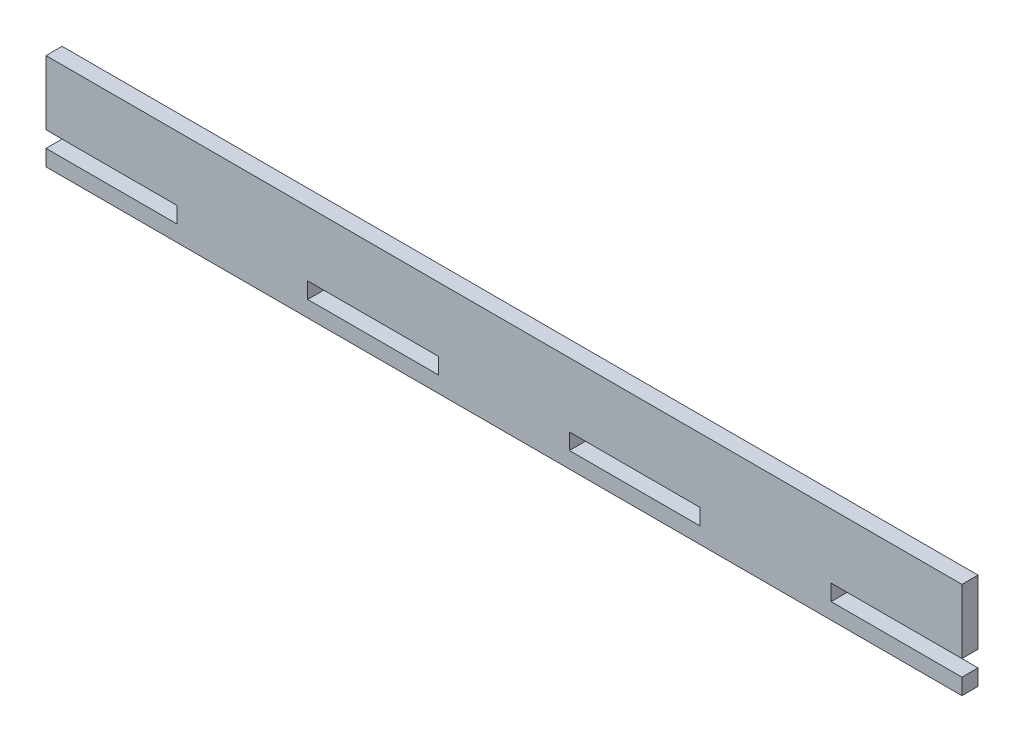
ISO-10303-21;
HEADER;
FILE_DESCRIPTION(('STEP AP214'),'2;1');
FILE_NAME('part.step','',(''),(''),'','','');
FILE_SCHEMA(('AUTOMOTIVE_DESIGN { 1 0 10303 214 1 1 1 1 }'));
ENDSEC;
DATA;
#1=APPLICATION_CONTEXT('core data for automotive mechanical design processes');
#2=APPLICATION_PROTOCOL_DEFINITION('international standard','automotive_design',2000,#1);
#3=PRODUCT_CONTEXT('',#1,'mechanical');
#4=PRODUCT('Part','Part','',(#3));
#5=PRODUCT_RELATED_PRODUCT_CATEGORY('part','',(#4));
#6=PRODUCT_DEFINITION_FORMATION('','',#4);
#7=PRODUCT_DEFINITION_CONTEXT('part definition',#1,'design');
#8=PRODUCT_DEFINITION('design','',#6,#7);
#9=PRODUCT_DEFINITION_SHAPE('','',#8);
#10=(LENGTH_UNIT() NAMED_UNIT(*) SI_UNIT(.MILLI.,.METRE.));
#11=(NAMED_UNIT(*) PLANE_ANGLE_UNIT() SI_UNIT($,.RADIAN.));
#12=(NAMED_UNIT(*) SI_UNIT($,.STERADIAN.) SOLID_ANGLE_UNIT());
#13=UNCERTAINTY_MEASURE_WITH_UNIT(LENGTH_MEASURE(1.E-05),#10,'distance_accuracy_value','');
#14=(GEOMETRIC_REPRESENTATION_CONTEXT(3) GLOBAL_UNCERTAINTY_ASSIGNED_CONTEXT((#13)) GLOBAL_UNIT_ASSIGNED_CONTEXT((#10,
#11,#12)) REPRESENTATION_CONTEXT('',''));
#15=CARTESIAN_POINT('',(0.,0.,0.));
#16=DIRECTION('',(0.,0.,1.));
#17=DIRECTION('',(1.,0.,0.));
#18=AXIS2_PLACEMENT_3D('',#15,#16,#17);
#19=CARTESIAN_POINT('',(0.,0.,5.));
#20=DIRECTION('',(0.,0.,-1.));
#21=DIRECTION('',(-1.,0.,0.));
#22=AXIS2_PLACEMENT_3D('',#19,#20,#21);
#23=PLANE('',#22);
#24=DIRECTION('',(0.,-1.,0.));
#25=VECTOR('',#24,1.);
#26=CARTESIAN_POINT('',(81.4285714285714,5.,5.));
#27=LINE('',#26,#25);
#28=CARTESIAN_POINT('',(81.4285714285714,10.,5.));
#29=VERTEX_POINT('',#28);
#30=CARTESIAN_POINT('',(81.4285714285714,5.,5.));
#31=VERTEX_POINT('',#30);
#32=EDGE_CURVE('E226',#29,#31,#27,.T.);
#33=ORIENTED_EDGE('',*,*,#32,.F.);
#34=DIRECTION('',(-1.,0.,0.));
#35=VECTOR('',#34,1.);
#36=CARTESIAN_POINT('',(81.4285714285714,10.,5.));
#37=LINE('',#36,#35);
#38=CARTESIAN_POINT('',(122.142857142857,10.,5.));
#39=VERTEX_POINT('',#38);
#40=EDGE_CURVE('E237',#39,#29,#37,.T.);
#41=ORIENTED_EDGE('',*,*,#40,.F.);
#42=DIRECTION('',(0.,1.,0.));
#43=VECTOR('',#42,1.);
#44=CARTESIAN_POINT('',(122.142857142857,5.,5.));
#45=LINE('',#44,#43);
#46=CARTESIAN_POINT('',(122.142857142857,5.,5.));
#47=VERTEX_POINT('',#46);
#48=EDGE_CURVE('E233',#47,#39,#45,.T.);
#49=ORIENTED_EDGE('',*,*,#48,.F.);
#50=DIRECTION('',(1.,0.,0.));
#51=VECTOR('',#50,1.);
#52=CARTESIAN_POINT('',(81.4285714285714,5.,5.));
#53=LINE('',#52,#51);
#54=EDGE_CURVE('E229',#31,#47,#53,.T.);
#55=ORIENTED_EDGE('',*,*,#54,.F.);
#56=EDGE_LOOP('',(#33,#41,#49,#55));
#57=FACE_BOUND('',#56,.T.);
#58=DIRECTION('',(0.,-1.,0.));
#59=VECTOR('',#58,1.);
#60=CARTESIAN_POINT('',(0.,0.,5.));
#61=LINE('',#60,#59);
#62=CARTESIAN_POINT('',(0.,5.,5.));
#63=VERTEX_POINT('',#62);
#64=CARTESIAN_POINT('',(0.,0.,5.));
#65=VERTEX_POINT('',#64);
#66=EDGE_CURVE('E269',#63,#65,#61,.T.);
#67=ORIENTED_EDGE('',*,*,#66,.T.);
#68=DIRECTION('',(1.,0.,0.));
#69=VECTOR('',#68,1.);
#70=CARTESIAN_POINT('',(0.,0.,5.));
#71=LINE('',#70,#69);
#72=CARTESIAN_POINT('',(285.,0.,5.));
#73=VERTEX_POINT('',#72);
#74=EDGE_CURVE('E273',#65,#73,#71,.T.);
#75=ORIENTED_EDGE('',*,*,#74,.T.);
#76=DIRECTION('',(0.,1.,0.));
#77=VECTOR('',#76,1.);
#78=CARTESIAN_POINT('',(285.,0.,5.));
#79=LINE('',#78,#77);
#80=CARTESIAN_POINT('',(285.,5.,5.));
#81=VERTEX_POINT('',#80);
#82=EDGE_CURVE('E277',#73,#81,#79,.T.);
#83=ORIENTED_EDGE('',*,*,#82,.T.);
#84=DIRECTION('',(-1.,0.,0.));
#85=VECTOR('',#84,1.);
#86=CARTESIAN_POINT('',(244.285714285714,5.,5.));
#87=LINE('',#86,#85);
#88=CARTESIAN_POINT('',(244.285714285714,5.,5.));
#89=VERTEX_POINT('',#88);
#90=EDGE_CURVE('E280',#81,#89,#87,.T.);
#91=ORIENTED_EDGE('',*,*,#90,.T.);
#92=DIRECTION('',(0.,1.,0.));
#93=VECTOR('',#92,1.);
#94=CARTESIAN_POINT('',(244.285714285714,5.,5.));
#95=LINE('',#94,#93);
#96=CARTESIAN_POINT('',(244.285714285714,10.,5.));
#97=VERTEX_POINT('',#96);
#98=EDGE_CURVE('E283',#89,#97,#95,.T.);
#99=ORIENTED_EDGE('',*,*,#98,.T.);
#100=DIRECTION('',(1.,0.,0.));
#101=VECTOR('',#100,1.);
#102=CARTESIAN_POINT('',(244.285714285714,10.,5.));
#103=LINE('',#102,#101);
#104=CARTESIAN_POINT('',(285.,10.,5.));
#105=VERTEX_POINT('',#104);
#106=EDGE_CURVE('E286',#97,#105,#103,.T.);
#107=ORIENTED_EDGE('',*,*,#106,.T.);
#108=DIRECTION('',(0.,1.,0.));
#109=VECTOR('',#108,1.);
#110=CARTESIAN_POINT('',(285.,10.,5.));
#111=LINE('',#110,#109);
#112=CARTESIAN_POINT('',(285.,30.,5.));
#113=VERTEX_POINT('',#112);
#114=EDGE_CURVE('E289',#105,#113,#111,.T.);
#115=ORIENTED_EDGE('',*,*,#114,.T.);
#116=DIRECTION('',(-1.,0.,0.));
#117=VECTOR('',#116,1.);
#118=CARTESIAN_POINT('',(0.,30.,5.));
#119=LINE('',#118,#117);
#120=CARTESIAN_POINT('',(0.,30.,5.));
#121=VERTEX_POINT('',#120);
#122=EDGE_CURVE('E292',#113,#121,#119,.T.);
#123=ORIENTED_EDGE('',*,*,#122,.T.);
#124=DIRECTION('',(0.,-1.,0.));
#125=VECTOR('',#124,1.);
#126=CARTESIAN_POINT('',(0.,10.,5.));
#127=LINE('',#126,#125);
#128=CARTESIAN_POINT('',(0.,10.,5.));
#129=VERTEX_POINT('',#128);
#130=EDGE_CURVE('E295',#121,#129,#127,.T.);
#131=ORIENTED_EDGE('',*,*,#130,.T.);
#132=DIRECTION('',(1.,0.,0.));
#133=VECTOR('',#132,1.);
#134=CARTESIAN_POINT('',(0.,10.,5.));
#135=LINE('',#134,#133);
#136=CARTESIAN_POINT('',(40.7142857142857,10.,5.));
#137=VERTEX_POINT('',#136);
#138=EDGE_CURVE('E298',#129,#137,#135,.T.);
#139=ORIENTED_EDGE('',*,*,#138,.T.);
#140=DIRECTION('',(0.,-1.,0.));
#141=VECTOR('',#140,1.);
#142=CARTESIAN_POINT('',(40.7142857142857,10.,5.));
#143=LINE('',#142,#141);
#144=CARTESIAN_POINT('',(40.7142857142857,5.,5.));
#145=VERTEX_POINT('',#144);
#146=EDGE_CURVE('E301',#137,#145,#143,.T.);
#147=ORIENTED_EDGE('',*,*,#146,.T.);
#148=DIRECTION('',(-1.,0.,0.));
#149=VECTOR('',#148,1.);
#150=CARTESIAN_POINT('',(0.,5.,5.));
#151=LINE('',#150,#149);
#152=EDGE_CURVE('E304',#145,#63,#151,.T.);
#153=ORIENTED_EDGE('',*,*,#152,.T.);
#154=EDGE_LOOP('',(#67,#75,#83,#91,#99,#107,#115,#123,#131,#139,#147,#153));
#155=FACE_BOUND('',#154,.T.);
#156=DIRECTION('',(0.,-1.,0.));
#157=VECTOR('',#156,1.);
#158=CARTESIAN_POINT('',(162.857142857143,5.,5.));
#159=LINE('',#158,#157);
#160=CARTESIAN_POINT('',(162.857142857143,10.,5.));
#161=VERTEX_POINT('',#160);
#162=CARTESIAN_POINT('',(162.857142857143,5.,5.));
#163=VERTEX_POINT('',#162);
#164=EDGE_CURVE('E178',#161,#163,#159,.T.);
#165=ORIENTED_EDGE('',*,*,#164,.F.);
#166=DIRECTION('',(-1.,0.,0.));
#167=VECTOR('',#166,1.);
#168=CARTESIAN_POINT('',(162.857142857143,10.,5.));
#169=LINE('',#168,#167);
#170=CARTESIAN_POINT('',(203.571428571429,10.,5.));
#171=VERTEX_POINT('',#170);
#172=EDGE_CURVE('E204',#171,#161,#169,.T.);
#173=ORIENTED_EDGE('',*,*,#172,.F.);
#174=DIRECTION('',(0.,1.,0.));
#175=VECTOR('',#174,1.);
#176=CARTESIAN_POINT('',(203.571428571429,5.,5.));
#177=LINE('',#176,#175);
#178=CARTESIAN_POINT('',(203.571428571429,5.,5.));
#179=VERTEX_POINT('',#178);
#180=EDGE_CURVE('E200',#179,#171,#177,.T.);
#181=ORIENTED_EDGE('',*,*,#180,.F.);
#182=DIRECTION('',(1.,0.,0.));
#183=VECTOR('',#182,1.);
#184=CARTESIAN_POINT('',(162.857142857143,5.,5.));
#185=LINE('',#184,#183);
#186=EDGE_CURVE('E187',#163,#179,#185,.T.);
#187=ORIENTED_EDGE('',*,*,#186,.F.);
#188=EDGE_LOOP('',(#165,#173,#181,#187));
#189=FACE_BOUND('',#188,.T.);
#190=ADVANCED_FACE('F40',(#57,#155,#189),#23,.F.);
#191=CARTESIAN_POINT('',(0.,0.,0.));
#192=DIRECTION('',(0.,0.,-1.));
#193=DIRECTION('',(-1.,0.,0.));
#194=AXIS2_PLACEMENT_3D('',#191,#192,#193);
#195=PLANE('',#194);
#196=DIRECTION('',(0.,-1.,0.));
#197=VECTOR('',#196,1.);
#198=CARTESIAN_POINT('',(0.,0.,0.));
#199=LINE('',#198,#197);
#200=CARTESIAN_POINT('',(0.,5.,0.));
#201=VERTEX_POINT('',#200);
#202=CARTESIAN_POINT('',(0.,0.,0.));
#203=VERTEX_POINT('',#202);
#204=EDGE_CURVE('E268',#201,#203,#199,.T.);
#205=ORIENTED_EDGE('',*,*,#204,.F.);
#206=DIRECTION('',(-1.,0.,0.));
#207=VECTOR('',#206,1.);
#208=CARTESIAN_POINT('',(0.,5.,0.));
#209=LINE('',#208,#207);
#210=CARTESIAN_POINT('',(40.7142857142857,5.,0.));
#211=VERTEX_POINT('',#210);
#212=EDGE_CURVE('E274',#211,#201,#209,.T.);
#213=ORIENTED_EDGE('',*,*,#212,.F.);
#214=DIRECTION('',(0.,-1.,0.));
#215=VECTOR('',#214,1.);
#216=CARTESIAN_POINT('',(40.7142857142857,10.,0.));
#217=LINE('',#216,#215);
#218=CARTESIAN_POINT('',(40.7142857142857,10.,0.));
#219=VERTEX_POINT('',#218);
#220=EDGE_CURVE('E338',#219,#211,#217,.T.);
#221=ORIENTED_EDGE('',*,*,#220,.F.);
#222=DIRECTION('',(1.,0.,0.));
#223=VECTOR('',#222,1.);
#224=CARTESIAN_POINT('',(0.,10.,0.));
#225=LINE('',#224,#223);
#226=CARTESIAN_POINT('',(0.,10.,0.));
#227=VERTEX_POINT('',#226);
#228=EDGE_CURVE('E335',#227,#219,#225,.T.);
#229=ORIENTED_EDGE('',*,*,#228,.F.);
#230=DIRECTION('',(0.,-1.,0.));
#231=VECTOR('',#230,1.);
#232=CARTESIAN_POINT('',(0.,10.,0.));
#233=LINE('',#232,#231);
#234=CARTESIAN_POINT('',(0.,30.,0.));
#235=VERTEX_POINT('',#234);
#236=EDGE_CURVE('E332',#235,#227,#233,.T.);
#237=ORIENTED_EDGE('',*,*,#236,.F.);
#238=DIRECTION('',(-1.,0.,0.));
#239=VECTOR('',#238,1.);
#240=CARTESIAN_POINT('',(0.,30.,0.));
#241=LINE('',#240,#239);
#242=CARTESIAN_POINT('',(285.,30.,0.));
#243=VERTEX_POINT('',#242);
#244=EDGE_CURVE('E329',#243,#235,#241,.T.);
#245=ORIENTED_EDGE('',*,*,#244,.F.);
#246=DIRECTION('',(0.,1.,0.));
#247=VECTOR('',#246,1.);
#248=CARTESIAN_POINT('',(285.,10.,0.));
#249=LINE('',#248,#247);
#250=CARTESIAN_POINT('',(285.,10.,0.));
#251=VERTEX_POINT('',#250);
#252=EDGE_CURVE('E326',#251,#243,#249,.T.);
#253=ORIENTED_EDGE('',*,*,#252,.F.);
#254=DIRECTION('',(1.,0.,0.));
#255=VECTOR('',#254,1.);
#256=CARTESIAN_POINT('',(244.285714285714,10.,0.));
#257=LINE('',#256,#255);
#258=CARTESIAN_POINT('',(244.285714285714,10.,0.));
#259=VERTEX_POINT('',#258);
#260=EDGE_CURVE('E323',#259,#251,#257,.T.);
#261=ORIENTED_EDGE('',*,*,#260,.F.);
#262=DIRECTION('',(0.,1.,0.));
#263=VECTOR('',#262,1.);
#264=CARTESIAN_POINT('',(244.285714285714,5.,0.));
#265=LINE('',#264,#263);
#266=CARTESIAN_POINT('',(244.285714285714,5.,0.));
#267=VERTEX_POINT('',#266);
#268=EDGE_CURVE('E320',#267,#259,#265,.T.);
#269=ORIENTED_EDGE('',*,*,#268,.F.);
#270=DIRECTION('',(-1.,0.,0.));
#271=VECTOR('',#270,1.);
#272=CARTESIAN_POINT('',(244.285714285714,5.,0.));
#273=LINE('',#272,#271);
#274=CARTESIAN_POINT('',(285.,5.,0.));
#275=VERTEX_POINT('',#274);
#276=EDGE_CURVE('E317',#275,#267,#273,.T.);
#277=ORIENTED_EDGE('',*,*,#276,.F.);
#278=DIRECTION('',(0.,1.,0.));
#279=VECTOR('',#278,1.);
#280=CARTESIAN_POINT('',(285.,0.,0.));
#281=LINE('',#280,#279);
#282=CARTESIAN_POINT('',(285.,0.,0.));
#283=VERTEX_POINT('',#282);
#284=EDGE_CURVE('E314',#283,#275,#281,.T.);
#285=ORIENTED_EDGE('',*,*,#284,.F.);
#286=DIRECTION('',(1.,0.,0.));
#287=VECTOR('',#286,1.);
#288=CARTESIAN_POINT('',(0.,0.,0.));
#289=LINE('',#288,#287);
#290=EDGE_CURVE('E311',#203,#283,#289,.T.);
#291=ORIENTED_EDGE('',*,*,#290,.F.);
#292=EDGE_LOOP('',(#205,#213,#221,#229,#237,#245,#253,#261,#269,#277,#285,#291));
#293=FACE_BOUND('',#292,.T.);
#294=DIRECTION('',(-1.,0.,0.));
#295=VECTOR('',#294,1.);
#296=CARTESIAN_POINT('',(81.4285714285714,10.,0.));
#297=LINE('',#296,#295);
#298=CARTESIAN_POINT('',(122.142857142857,10.,0.));
#299=VERTEX_POINT('',#298);
#300=CARTESIAN_POINT('',(81.4285714285714,10.,0.));
#301=VERTEX_POINT('',#300);
#302=EDGE_CURVE('E230',#299,#301,#297,.T.);
#303=ORIENTED_EDGE('',*,*,#302,.T.);
#304=DIRECTION('',(0.,-1.,0.));
#305=VECTOR('',#304,1.);
#306=CARTESIAN_POINT('',(81.4285714285714,5.,0.));
#307=LINE('',#306,#305);
#308=CARTESIAN_POINT('',(81.4285714285714,5.,0.));
#309=VERTEX_POINT('',#308);
#310=EDGE_CURVE('E196',#301,#309,#307,.T.);
#311=ORIENTED_EDGE('',*,*,#310,.T.);
#312=DIRECTION('',(1.,0.,0.));
#313=VECTOR('',#312,1.);
#314=CARTESIAN_POINT('',(81.4285714285714,5.,0.));
#315=LINE('',#314,#313);
#316=CARTESIAN_POINT('',(122.142857142857,5.,0.));
#317=VERTEX_POINT('',#316);
#318=EDGE_CURVE('E244',#309,#317,#315,.T.);
#319=ORIENTED_EDGE('',*,*,#318,.T.);
#320=DIRECTION('',(0.,1.,0.));
#321=VECTOR('',#320,1.);
#322=CARTESIAN_POINT('',(122.142857142857,5.,0.));
#323=LINE('',#322,#321);
#324=EDGE_CURVE('E248',#317,#299,#323,.T.);
#325=ORIENTED_EDGE('',*,*,#324,.T.);
#326=EDGE_LOOP('',(#303,#311,#319,#325));
#327=FACE_BOUND('',#326,.T.);
#328=DIRECTION('',(-1.,0.,0.));
#329=VECTOR('',#328,1.);
#330=CARTESIAN_POINT('',(162.857142857143,10.,0.));
#331=LINE('',#330,#329);
#332=CARTESIAN_POINT('',(203.571428571429,10.,0.));
#333=VERTEX_POINT('',#332);
#334=CARTESIAN_POINT('',(162.857142857143,10.,0.));
#335=VERTEX_POINT('',#334);
#336=EDGE_CURVE('E188',#333,#335,#331,.T.);
#337=ORIENTED_EDGE('',*,*,#336,.T.);
#338=DIRECTION('',(0.,-1.,0.));
#339=VECTOR('',#338,1.);
#340=CARTESIAN_POINT('',(162.857142857143,5.,0.));
#341=LINE('',#340,#339);
#342=CARTESIAN_POINT('',(162.857142857143,5.,0.));
#343=VERTEX_POINT('',#342);
#344=EDGE_CURVE('E64',#335,#343,#341,.T.);
#345=ORIENTED_EDGE('',*,*,#344,.T.);
#346=DIRECTION('',(1.,0.,0.));
#347=VECTOR('',#346,1.);
#348=CARTESIAN_POINT('',(162.857142857143,5.,0.));
#349=LINE('',#348,#347);
#350=CARTESIAN_POINT('',(203.571428571429,5.,0.));
#351=VERTEX_POINT('',#350);
#352=EDGE_CURVE('E194',#343,#351,#349,.T.);
#353=ORIENTED_EDGE('',*,*,#352,.T.);
#354=DIRECTION('',(0.,1.,0.));
#355=VECTOR('',#354,1.);
#356=CARTESIAN_POINT('',(203.571428571429,5.,0.));
#357=LINE('',#356,#355);
#358=EDGE_CURVE('E213',#351,#333,#357,.T.);
#359=ORIENTED_EDGE('',*,*,#358,.T.);
#360=EDGE_LOOP('',(#337,#345,#353,#359));
#361=FACE_BOUND('',#360,.T.);
#362=ADVANCED_FACE('F393',(#293,#327,#361),#195,.T.);
#363=CARTESIAN_POINT('',(0.,0.,5.));
#364=DIRECTION('',(1.,0.,0.));
#365=DIRECTION('',(0.,1.,0.));
#366=AXIS2_PLACEMENT_3D('',#363,#364,#365);
#367=PLANE('',#366);
#368=ORIENTED_EDGE('',*,*,#204,.T.);
#369=DIRECTION('',(0.,0.,-1.));
#370=VECTOR('',#369,1.);
#371=CARTESIAN_POINT('',(0.,0.,5.));
#372=LINE('',#371,#370);
#373=EDGE_CURVE('E11',#65,#203,#372,.T.);
#374=ORIENTED_EDGE('',*,*,#373,.F.);
#375=ORIENTED_EDGE('',*,*,#66,.F.);
#376=DIRECTION('',(0.,0.,-1.));
#377=VECTOR('',#376,1.);
#378=CARTESIAN_POINT('',(0.,5.,5.));
#379=LINE('',#378,#377);
#380=EDGE_CURVE('E307',#63,#201,#379,.T.);
#381=ORIENTED_EDGE('',*,*,#380,.T.);
#382=EDGE_LOOP('',(#368,#374,#375,#381));
#383=FACE_BOUND('',#382,.T.);
#384=ADVANCED_FACE('F42',(#383),#367,.F.);
#385=CARTESIAN_POINT('',(0.,0.,5.));
#386=DIRECTION('',(0.,1.,0.));
#387=DIRECTION('',(0.,0.,1.));
#388=AXIS2_PLACEMENT_3D('',#385,#386,#387);
#389=PLANE('',#388);
#390=ORIENTED_EDGE('',*,*,#290,.T.);
#391=DIRECTION('',(0.,0.,-1.));
#392=VECTOR('',#391,1.);
#393=CARTESIAN_POINT('',(285.,0.,5.));
#394=LINE('',#393,#392);
#395=EDGE_CURVE('E49',#73,#283,#394,.T.);
#396=ORIENTED_EDGE('',*,*,#395,.F.);
#397=ORIENTED_EDGE('',*,*,#74,.F.);
#398=ORIENTED_EDGE('',*,*,#373,.T.);
#399=EDGE_LOOP('',(#390,#396,#397,#398));
#400=FACE_BOUND('',#399,.T.);
#401=ADVANCED_FACE('F410',(#400),#389,.F.);
#402=CARTESIAN_POINT('',(285.,0.,5.));
#403=DIRECTION('',(-1.,0.,0.));
#404=DIRECTION('',(0.,0.,1.));
#405=AXIS2_PLACEMENT_3D('',#402,#403,#404);
#406=PLANE('',#405);
#407=ORIENTED_EDGE('',*,*,#284,.T.);
#408=DIRECTION('',(0.,0.,-1.));
#409=VECTOR('',#408,1.);
#410=CARTESIAN_POINT('',(285.,5.,5.));
#411=LINE('',#410,#409);
#412=EDGE_CURVE('E378',#81,#275,#411,.T.);
#413=ORIENTED_EDGE('',*,*,#412,.F.);
#414=ORIENTED_EDGE('',*,*,#82,.F.);
#415=ORIENTED_EDGE('',*,*,#395,.T.);
#416=EDGE_LOOP('',(#407,#413,#414,#415));
#417=FACE_BOUND('',#416,.T.);
#418=ADVANCED_FACE('F387',(#417),#406,.F.);
#419=CARTESIAN_POINT('',(244.285714285714,5.,5.));
#420=DIRECTION('',(0.,-1.,0.));
#421=DIRECTION('',(0.,0.,-1.));
#422=AXIS2_PLACEMENT_3D('',#419,#420,#421);
#423=PLANE('',#422);
#424=ORIENTED_EDGE('',*,*,#276,.T.);
#425=DIRECTION('',(0.,0.,-1.));
#426=VECTOR('',#425,1.);
#427=CARTESIAN_POINT('',(244.285714285714,5.,5.));
#428=LINE('',#427,#426);
#429=EDGE_CURVE('E374',#89,#267,#428,.T.);
#430=ORIENTED_EDGE('',*,*,#429,.F.);
#431=ORIENTED_EDGE('',*,*,#90,.F.);
#432=ORIENTED_EDGE('',*,*,#412,.T.);
#433=EDGE_LOOP('',(#424,#430,#431,#432));
#434=FACE_BOUND('',#433,.T.);
#435=ADVANCED_FACE('F399',(#434),#423,.F.);
#436=CARTESIAN_POINT('',(244.285714285714,5.,5.));
#437=DIRECTION('',(-1.,0.,0.));
#438=DIRECTION('',(0.,0.,1.));
#439=AXIS2_PLACEMENT_3D('',#436,#437,#438);
#440=PLANE('',#439);
#441=ORIENTED_EDGE('',*,*,#268,.T.);
#442=DIRECTION('',(0.,0.,-1.));
#443=VECTOR('',#442,1.);
#444=CARTESIAN_POINT('',(244.285714285714,10.,5.));
#445=LINE('',#444,#443);
#446=EDGE_CURVE('E370',#97,#259,#445,.T.);
#447=ORIENTED_EDGE('',*,*,#446,.F.);
#448=ORIENTED_EDGE('',*,*,#98,.F.);
#449=ORIENTED_EDGE('',*,*,#429,.T.);
#450=EDGE_LOOP('',(#441,#447,#448,#449));
#451=FACE_BOUND('',#450,.T.);
#452=ADVANCED_FACE('F403',(#451),#440,.F.);
#453=CARTESIAN_POINT('',(244.285714285714,10.,5.));
#454=DIRECTION('',(0.,1.,0.));
#455=DIRECTION('',(0.,0.,1.));
#456=AXIS2_PLACEMENT_3D('',#453,#454,#455);
#457=PLANE('',#456);
#458=ORIENTED_EDGE('',*,*,#260,.T.);
#459=DIRECTION('',(0.,0.,-1.));
#460=VECTOR('',#459,1.);
#461=CARTESIAN_POINT('',(285.,10.,5.));
#462=LINE('',#461,#460);
#463=EDGE_CURVE('E366',#105,#251,#462,.T.);
#464=ORIENTED_EDGE('',*,*,#463,.F.);
#465=ORIENTED_EDGE('',*,*,#106,.F.);
#466=ORIENTED_EDGE('',*,*,#446,.T.);
#467=EDGE_LOOP('',(#458,#464,#465,#466));
#468=FACE_BOUND('',#467,.T.);
#469=ADVANCED_FACE('F443',(#468),#457,.F.);
#470=CARTESIAN_POINT('',(285.,10.,5.));
#471=DIRECTION('',(-1.,0.,0.));
#472=DIRECTION('',(0.,0.,1.));
#473=AXIS2_PLACEMENT_3D('',#470,#471,#472);
#474=PLANE('',#473);
#475=ORIENTED_EDGE('',*,*,#252,.T.);
#476=DIRECTION('',(0.,0.,-1.));
#477=VECTOR('',#476,1.);
#478=CARTESIAN_POINT('',(285.,30.,5.));
#479=LINE('',#478,#477);
#480=EDGE_CURVE('E362',#113,#243,#479,.T.);
#481=ORIENTED_EDGE('',*,*,#480,.F.);
#482=ORIENTED_EDGE('',*,*,#114,.F.);
#483=ORIENTED_EDGE('',*,*,#463,.T.);
#484=EDGE_LOOP('',(#475,#481,#482,#483));
#485=FACE_BOUND('',#484,.T.);
#486=ADVANCED_FACE('F441',(#485),#474,.F.);
#487=CARTESIAN_POINT('',(0.,30.,5.));
#488=DIRECTION('',(0.,-1.,0.));
#489=DIRECTION('',(0.,0.,-1.));
#490=AXIS2_PLACEMENT_3D('',#487,#488,#489);
#491=PLANE('',#490);
#492=ORIENTED_EDGE('',*,*,#244,.T.);
#493=DIRECTION('',(0.,0.,-1.));
#494=VECTOR('',#493,1.);
#495=CARTESIAN_POINT('',(0.,30.,5.));
#496=LINE('',#495,#494);
#497=EDGE_CURVE('E358',#121,#235,#496,.T.);
#498=ORIENTED_EDGE('',*,*,#497,.F.);
#499=ORIENTED_EDGE('',*,*,#122,.F.);
#500=ORIENTED_EDGE('',*,*,#480,.T.);
#501=EDGE_LOOP('',(#492,#498,#499,#500));
#502=FACE_BOUND('',#501,.T.);
#503=ADVANCED_FACE('F437',(#502),#491,.F.);
#504=CARTESIAN_POINT('',(0.,10.,5.));
#505=DIRECTION('',(1.,0.,0.));
#506=DIRECTION('',(0.,1.,0.));
#507=AXIS2_PLACEMENT_3D('',#504,#505,#506);
#508=PLANE('',#507);
#509=ORIENTED_EDGE('',*,*,#236,.T.);
#510=DIRECTION('',(0.,0.,-1.));
#511=VECTOR('',#510,1.);
#512=CARTESIAN_POINT('',(0.,10.,5.));
#513=LINE('',#512,#511);
#514=EDGE_CURVE('E354',#129,#227,#513,.T.);
#515=ORIENTED_EDGE('',*,*,#514,.F.);
#516=ORIENTED_EDGE('',*,*,#130,.F.);
#517=ORIENTED_EDGE('',*,*,#497,.T.);
#518=EDGE_LOOP('',(#509,#515,#516,#517));
#519=FACE_BOUND('',#518,.T.);
#520=ADVANCED_FACE('F432',(#519),#508,.F.);
#521=CARTESIAN_POINT('',(0.,10.,5.));
#522=DIRECTION('',(0.,1.,0.));
#523=DIRECTION('',(-1.,0.,0.));
#524=AXIS2_PLACEMENT_3D('',#521,#522,#523);
#525=PLANE('',#524);
#526=ORIENTED_EDGE('',*,*,#228,.T.);
#527=DIRECTION('',(0.,0.,-1.));
#528=VECTOR('',#527,1.);
#529=CARTESIAN_POINT('',(40.7142857142857,10.,5.));
#530=LINE('',#529,#528);
#531=EDGE_CURVE('E350',#137,#219,#530,.T.);
#532=ORIENTED_EDGE('',*,*,#531,.F.);
#533=ORIENTED_EDGE('',*,*,#138,.F.);
#534=ORIENTED_EDGE('',*,*,#514,.T.);
#535=EDGE_LOOP('',(#526,#532,#533,#534));
#536=FACE_BOUND('',#535,.T.);
#537=ADVANCED_FACE('F426',(#536),#525,.F.);
#538=CARTESIAN_POINT('',(40.7142857142857,10.,5.));
#539=DIRECTION('',(1.,0.,0.));
#540=DIRECTION('',(0.,0.,-1.));
#541=AXIS2_PLACEMENT_3D('',#538,#539,#540);
#542=PLANE('',#541);
#543=ORIENTED_EDGE('',*,*,#220,.T.);
#544=DIRECTION('',(0.,0.,-1.));
#545=VECTOR('',#544,1.);
#546=CARTESIAN_POINT('',(40.7142857142857,5.,5.));
#547=LINE('',#546,#545);
#548=EDGE_CURVE('E346',#145,#211,#547,.T.);
#549=ORIENTED_EDGE('',*,*,#548,.F.);
#550=ORIENTED_EDGE('',*,*,#146,.F.);
#551=ORIENTED_EDGE('',*,*,#531,.T.);
#552=EDGE_LOOP('',(#543,#549,#550,#551));
#553=FACE_BOUND('',#552,.T.);
#554=ADVANCED_FACE('F422',(#553),#542,.F.);
#555=CARTESIAN_POINT('',(0.,5.,5.));
#556=DIRECTION('',(0.,-1.,0.));
#557=DIRECTION('',(0.,0.,-1.));
#558=AXIS2_PLACEMENT_3D('',#555,#556,#557);
#559=PLANE('',#558);
#560=ORIENTED_EDGE('',*,*,#212,.T.);
#561=ORIENTED_EDGE('',*,*,#380,.F.);
#562=ORIENTED_EDGE('',*,*,#152,.F.);
#563=ORIENTED_EDGE('',*,*,#548,.T.);
#564=EDGE_LOOP('',(#560,#561,#562,#563));
#565=FACE_BOUND('',#564,.T.);
#566=ADVANCED_FACE('F417',(#565),#559,.F.);
#567=CARTESIAN_POINT('',(81.4285714285714,5.,5.));
#568=DIRECTION('',(1.,0.,0.));
#569=DIRECTION('',(0.,0.,-1.));
#570=AXIS2_PLACEMENT_3D('',#567,#568,#569);
#571=PLANE('',#570);
#572=ORIENTED_EDGE('',*,*,#310,.F.);
#573=DIRECTION('',(0.,0.,-1.));
#574=VECTOR('',#573,1.);
#575=CARTESIAN_POINT('',(81.4285714285714,10.,5.));
#576=LINE('',#575,#574);
#577=EDGE_CURVE('E240',#29,#301,#576,.T.);
#578=ORIENTED_EDGE('',*,*,#577,.F.);
#579=ORIENTED_EDGE('',*,*,#32,.T.);
#580=DIRECTION('',(0.,0.,-1.));
#581=VECTOR('',#580,1.);
#582=CARTESIAN_POINT('',(81.4285714285714,5.,5.));
#583=LINE('',#582,#581);
#584=EDGE_CURVE('E264',#31,#309,#583,.T.);
#585=ORIENTED_EDGE('',*,*,#584,.T.);
#586=EDGE_LOOP('',(#572,#578,#579,#585));
#587=FACE_BOUND('',#586,.T.);
#588=ADVANCED_FACE('F461',(#587),#571,.T.);
#589=CARTESIAN_POINT('',(81.4285714285714,5.,5.));
#590=DIRECTION('',(0.,1.,0.));
#591=DIRECTION('',(0.,0.,1.));
#592=AXIS2_PLACEMENT_3D('',#589,#590,#591);
#593=PLANE('',#592);
#594=ORIENTED_EDGE('',*,*,#318,.F.);
#595=ORIENTED_EDGE('',*,*,#584,.F.);
#596=ORIENTED_EDGE('',*,*,#54,.T.);
#597=DIRECTION('',(0.,0.,-1.));
#598=VECTOR('',#597,1.);
#599=CARTESIAN_POINT('',(122.142857142857,5.,5.));
#600=LINE('',#599,#598);
#601=EDGE_CURVE('E261',#47,#317,#600,.T.);
#602=ORIENTED_EDGE('',*,*,#601,.T.);
#603=EDGE_LOOP('',(#594,#595,#596,#602));
#604=FACE_BOUND('',#603,.T.);
#605=ADVANCED_FACE('F499',(#604),#593,.T.);
#606=CARTESIAN_POINT('',(122.142857142857,5.,5.));
#607=DIRECTION('',(-1.,0.,0.));
#608=DIRECTION('',(0.,0.,1.));
#609=AXIS2_PLACEMENT_3D('',#606,#607,#608);
#610=PLANE('',#609);
#611=ORIENTED_EDGE('',*,*,#324,.F.);
#612=ORIENTED_EDGE('',*,*,#601,.F.);
#613=ORIENTED_EDGE('',*,*,#48,.T.);
#614=DIRECTION('',(0.,0.,-1.));
#615=VECTOR('',#614,1.);
#616=CARTESIAN_POINT('',(122.142857142857,10.,5.));
#617=LINE('',#616,#615);
#618=EDGE_CURVE('E258',#39,#299,#617,.T.);
#619=ORIENTED_EDGE('',*,*,#618,.T.);
#620=EDGE_LOOP('',(#611,#612,#613,#619));
#621=FACE_BOUND('',#620,.T.);
#622=ADVANCED_FACE('F506',(#621),#610,.T.);
#623=CARTESIAN_POINT('',(81.4285714285714,10.,5.));
#624=DIRECTION('',(0.,-1.,0.));
#625=DIRECTION('',(0.,0.,-1.));
#626=AXIS2_PLACEMENT_3D('',#623,#624,#625);
#627=PLANE('',#626);
#628=ORIENTED_EDGE('',*,*,#302,.F.);
#629=ORIENTED_EDGE('',*,*,#618,.F.);
#630=ORIENTED_EDGE('',*,*,#40,.T.);
#631=ORIENTED_EDGE('',*,*,#577,.T.);
#632=EDGE_LOOP('',(#628,#629,#630,#631));
#633=FACE_BOUND('',#632,.T.);
#634=ADVANCED_FACE('F513',(#633),#627,.T.);
#635=CARTESIAN_POINT('',(162.857142857143,5.,5.));
#636=DIRECTION('',(1.,0.,0.));
#637=DIRECTION('',(0.,0.,-1.));
#638=AXIS2_PLACEMENT_3D('',#635,#636,#637);
#639=PLANE('',#638);
#640=ORIENTED_EDGE('',*,*,#344,.F.);
#641=DIRECTION('',(0.,0.,-1.));
#642=VECTOR('',#641,1.);
#643=CARTESIAN_POINT('',(162.857142857143,10.,5.));
#644=LINE('',#643,#642);
#645=EDGE_CURVE('E182',#161,#335,#644,.T.);
#646=ORIENTED_EDGE('',*,*,#645,.F.);
#647=ORIENTED_EDGE('',*,*,#164,.T.);
#648=DIRECTION('',(0.,0.,-1.));
#649=VECTOR('',#648,1.);
#650=CARTESIAN_POINT('',(162.857142857143,5.,5.));
#651=LINE('',#650,#649);
#652=EDGE_CURVE('E181',#163,#343,#651,.T.);
#653=ORIENTED_EDGE('',*,*,#652,.T.);
#654=EDGE_LOOP('',(#640,#646,#647,#653));
#655=FACE_BOUND('',#654,.T.);
#656=ADVANCED_FACE('F180',(#655),#639,.T.);
#657=CARTESIAN_POINT('',(162.857142857143,5.,5.));
#658=DIRECTION('',(0.,1.,0.));
#659=DIRECTION('',(0.,0.,1.));
#660=AXIS2_PLACEMENT_3D('',#657,#658,#659);
#661=PLANE('',#660);
#662=ORIENTED_EDGE('',*,*,#352,.F.);
#663=ORIENTED_EDGE('',*,*,#652,.F.);
#664=ORIENTED_EDGE('',*,*,#186,.T.);
#665=DIRECTION('',(0.,0.,-1.));
#666=VECTOR('',#665,1.);
#667=CARTESIAN_POINT('',(203.571428571429,5.,5.));
#668=LINE('',#667,#666);
#669=EDGE_CURVE('E197',#179,#351,#668,.T.);
#670=ORIENTED_EDGE('',*,*,#669,.T.);
#671=EDGE_LOOP('',(#662,#663,#664,#670));
#672=FACE_BOUND('',#671,.T.);
#673=ADVANCED_FACE('F191',(#672),#661,.T.);
#674=CARTESIAN_POINT('',(203.571428571429,5.,5.));
#675=DIRECTION('',(-1.,0.,0.));
#676=DIRECTION('',(0.,0.,1.));
#677=AXIS2_PLACEMENT_3D('',#674,#675,#676);
#678=PLANE('',#677);
#679=ORIENTED_EDGE('',*,*,#358,.F.);
#680=ORIENTED_EDGE('',*,*,#669,.F.);
#681=ORIENTED_EDGE('',*,*,#180,.T.);
#682=DIRECTION('',(0.,0.,-1.));
#683=VECTOR('',#682,1.);
#684=CARTESIAN_POINT('',(203.571428571429,10.,5.));
#685=LINE('',#684,#683);
#686=EDGE_CURVE('E56',#171,#333,#685,.T.);
#687=ORIENTED_EDGE('',*,*,#686,.T.);
#688=EDGE_LOOP('',(#679,#680,#681,#687));
#689=FACE_BOUND('',#688,.T.);
#690=ADVANCED_FACE('F534',(#689),#678,.T.);
#691=CARTESIAN_POINT('',(162.857142857143,10.,5.));
#692=DIRECTION('',(0.,-1.,0.));
#693=DIRECTION('',(0.,0.,-1.));
#694=AXIS2_PLACEMENT_3D('',#691,#692,#693);
#695=PLANE('',#694);
#696=ORIENTED_EDGE('',*,*,#336,.F.);
#697=ORIENTED_EDGE('',*,*,#686,.F.);
#698=ORIENTED_EDGE('',*,*,#172,.T.);
#699=ORIENTED_EDGE('',*,*,#645,.T.);
#700=EDGE_LOOP('',(#696,#697,#698,#699));
#701=FACE_BOUND('',#700,.T.);
#702=ADVANCED_FACE('F541',(#701),#695,.T.);
#703=CLOSED_SHELL('',(#190,#362,#384,#401,#418,#435,#452,#469,#486,#503,#520,#537,#554,#566,
#588,#605,#622,#634,#656,#673,#690,#702));
#704=MANIFOLD_SOLID_BREP('B2',#703);
#705=ADVANCED_BREP_SHAPE_REPRESENTATION('',(#18,#704),#14);
#706=SHAPE_DEFINITION_REPRESENTATION(#9,#705);
ENDSEC;
END-ISO-10303-21;
